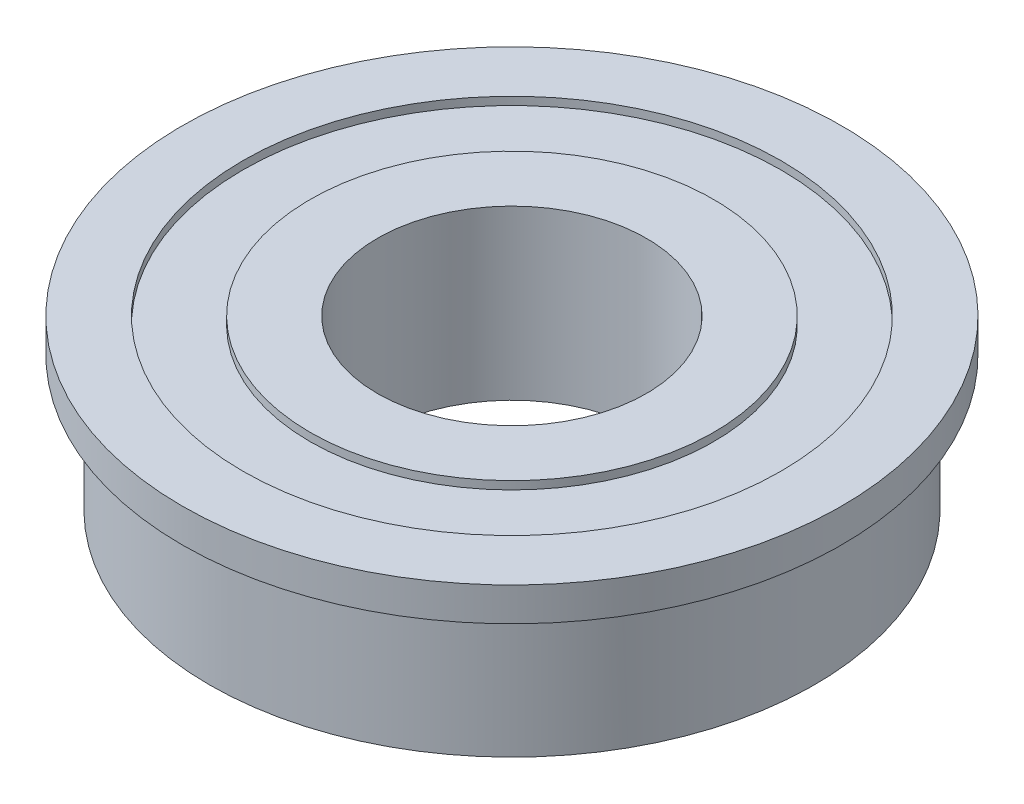
ISO-10303-21;
HEADER;
FILE_DESCRIPTION(('STEP AP214'),'2;1');
FILE_NAME('part.step','',(''),(''),'','','');
FILE_SCHEMA(('AUTOMOTIVE_DESIGN { 1 0 10303 214 1 1 1 1 }'));
ENDSEC;
DATA;
#1=APPLICATION_CONTEXT('core data for automotive mechanical design processes');
#2=APPLICATION_PROTOCOL_DEFINITION('international standard','automotive_design',2000,#1);
#3=PRODUCT_CONTEXT('',#1,'mechanical');
#4=PRODUCT('Part','Part','',(#3));
#5=PRODUCT_RELATED_PRODUCT_CATEGORY('part','',(#4));
#6=PRODUCT_DEFINITION_FORMATION('','',#4);
#7=PRODUCT_DEFINITION_CONTEXT('part definition',#1,'design');
#8=PRODUCT_DEFINITION('design','',#6,#7);
#9=PRODUCT_DEFINITION_SHAPE('','',#8);
#10=(LENGTH_UNIT() NAMED_UNIT(*) SI_UNIT(.MILLI.,.METRE.));
#11=(NAMED_UNIT(*) PLANE_ANGLE_UNIT() SI_UNIT($,.RADIAN.));
#12=(NAMED_UNIT(*) SI_UNIT($,.STERADIAN.) SOLID_ANGLE_UNIT());
#13=UNCERTAINTY_MEASURE_WITH_UNIT(LENGTH_MEASURE(1.E-05),#10,'distance_accuracy_value','');
#14=(GEOMETRIC_REPRESENTATION_CONTEXT(3) GLOBAL_UNCERTAINTY_ASSIGNED_CONTEXT((#13)) GLOBAL_UNIT_ASSIGNED_CONTEXT((#10,
#11,#12)) REPRESENTATION_CONTEXT('',''));
#15=CARTESIAN_POINT('',(0.,0.,0.));
#16=DIRECTION('',(0.,0.,1.));
#17=DIRECTION('',(1.,0.,0.));
#18=AXIS2_PLACEMENT_3D('',#15,#16,#17);
#19=CARTESIAN_POINT('',(12.7,7.9375,0.));
#20=DIRECTION('',(0.,1.,0.));
#21=DIRECTION('',(0.,0.,1.));
#22=AXIS2_PLACEMENT_3D('',#19,#20,#21);
#23=PLANE('',#22);
#24=CARTESIAN_POINT('',(0.,7.9375,0.));
#25=DIRECTION('',(0.,1.,0.));
#26=DIRECTION('',(0.,0.,1.));
#27=AXIS2_PLACEMENT_3D('',#24,#25,#26);
#28=CIRCLE('',#27,12.7);
#29=CARTESIAN_POINT('',(0.,7.9375,12.7));
#30=VERTEX_POINT('',#29);
#31=EDGE_CURVE('E93',#30,#30,#28,.F.);
#32=ORIENTED_EDGE('',*,*,#31,.T.);
#33=EDGE_LOOP('',(#32));
#34=FACE_BOUND('',#33,.T.);
#35=CARTESIAN_POINT('',(0.,7.9375,0.));
#36=DIRECTION('',(0.,1.,0.));
#37=DIRECTION('',(0.,0.,1.));
#38=AXIS2_PLACEMENT_3D('',#35,#36,#37);
#39=CIRCLE('',#38,15.5575);
#40=CARTESIAN_POINT('',(0.,7.9375,15.5575));
#41=VERTEX_POINT('',#40);
#42=EDGE_CURVE('E49',#41,#41,#39,.F.);
#43=ORIENTED_EDGE('',*,*,#42,.F.);
#44=EDGE_LOOP('',(#43));
#45=FACE_BOUND('',#44,.T.);
#46=ADVANCED_FACE('F16',(#34,#45),#23,.T.);
#47=CARTESIAN_POINT('',(0.,0.,0.));
#48=DIRECTION('',(0.,1.,0.));
#49=DIRECTION('',(0.,0.,1.));
#50=AXIS2_PLACEMENT_3D('',#47,#48,#49);
#51=CYLINDRICAL_SURFACE('',#50,15.5575);
#52=CARTESIAN_POINT('',(0.,6.35,0.));
#53=DIRECTION('',(0.,1.,0.));
#54=DIRECTION('',(0.,0.,1.));
#55=AXIS2_PLACEMENT_3D('',#52,#53,#54);
#56=CIRCLE('',#55,15.5575);
#57=CARTESIAN_POINT('',(0.,6.35,15.5575));
#58=VERTEX_POINT('',#57);
#59=EDGE_CURVE('E91',#58,#58,#56,.F.);
#60=ORIENTED_EDGE('',*,*,#59,.F.);
#61=EDGE_LOOP('',(#60));
#62=FACE_BOUND('',#61,.T.);
#63=ORIENTED_EDGE('',*,*,#42,.T.);
#64=EDGE_LOOP('',(#63));
#65=FACE_BOUND('',#64,.T.);
#66=ADVANCED_FACE('F100',(#62,#65),#51,.T.);
#67=CARTESIAN_POINT('',(0.,0.,0.));
#68=DIRECTION('',(0.,1.,0.));
#69=DIRECTION('',(0.,0.,1.));
#70=AXIS2_PLACEMENT_3D('',#67,#68,#69);
#71=CYLINDRICAL_SURFACE('',#70,12.7);
#72=ORIENTED_EDGE('',*,*,#31,.F.);
#73=EDGE_LOOP('',(#72));
#74=FACE_BOUND('',#73,.T.);
#75=CARTESIAN_POINT('',(0.,7.5565,0.));
#76=DIRECTION('',(0.,1.,0.));
#77=DIRECTION('',(0.,0.,1.));
#78=AXIS2_PLACEMENT_3D('',#75,#76,#77);
#79=CIRCLE('',#78,12.7);
#80=CARTESIAN_POINT('',(0.,7.5565,12.7));
#81=VERTEX_POINT('',#80);
#82=EDGE_CURVE('E40',#81,#81,#79,.T.);
#83=ORIENTED_EDGE('',*,*,#82,.F.);
#84=EDGE_LOOP('',(#83));
#85=FACE_BOUND('',#84,.T.);
#86=ADVANCED_FACE('F107',(#74,#85),#71,.F.);
#87=CARTESIAN_POINT('',(15.5575,6.35,0.));
#88=DIRECTION('',(0.,-1.,0.));
#89=DIRECTION('',(0.,0.,-1.));
#90=AXIS2_PLACEMENT_3D('',#87,#88,#89);
#91=PLANE('',#90);
#92=ORIENTED_EDGE('',*,*,#59,.T.);
#93=EDGE_LOOP('',(#92));
#94=FACE_BOUND('',#93,.T.);
#95=CARTESIAN_POINT('',(0.,6.35,0.));
#96=DIRECTION('',(0.,-1.,0.));
#97=DIRECTION('',(0.,0.,-1.));
#98=AXIS2_PLACEMENT_3D('',#95,#96,#97);
#99=CIRCLE('',#98,14.2875);
#100=CARTESIAN_POINT('',(0.,6.35,14.2875));
#101=VERTEX_POINT('',#100);
#102=CARTESIAN_POINT('',(0.,6.35,-14.2875));
#103=VERTEX_POINT('',#102);
#104=EDGE_CURVE('E36',#101,#103,#99,.F.);
#105=ORIENTED_EDGE('',*,*,#104,.T.);
#106=CARTESIAN_POINT('',(0.,6.35,0.));
#107=DIRECTION('',(0.,-1.,0.));
#108=DIRECTION('',(0.,0.,1.));
#109=AXIS2_PLACEMENT_3D('',#106,#107,#108);
#110=CIRCLE('',#109,14.2875);
#111=EDGE_CURVE('E33',#103,#101,#110,.F.);
#112=ORIENTED_EDGE('',*,*,#111,.T.);
#113=EDGE_LOOP('',(#105,#112));
#114=FACE_BOUND('',#113,.T.);
#115=ADVANCED_FACE('F38',(#94,#114),#91,.T.);
#116=CARTESIAN_POINT('',(9.525,7.5565,0.));
#117=DIRECTION('',(0.,1.,0.));
#118=DIRECTION('',(0.,0.,1.));
#119=AXIS2_PLACEMENT_3D('',#116,#117,#118);
#120=PLANE('',#119);
#121=CARTESIAN_POINT('',(0.,7.5565,0.));
#122=DIRECTION('',(0.,1.,0.));
#123=DIRECTION('',(0.,0.,1.));
#124=AXIS2_PLACEMENT_3D('',#121,#122,#123);
#125=CIRCLE('',#124,9.525);
#126=CARTESIAN_POINT('',(0.,7.5565,9.525));
#127=VERTEX_POINT('',#126);
#128=EDGE_CURVE('E46',#127,#127,#125,.T.);
#129=ORIENTED_EDGE('',*,*,#128,.F.);
#130=EDGE_LOOP('',(#129));
#131=FACE_BOUND('',#130,.T.);
#132=ORIENTED_EDGE('',*,*,#82,.T.);
#133=EDGE_LOOP('',(#132));
#134=FACE_BOUND('',#133,.T.);
#135=ADVANCED_FACE('F139',(#131,#134),#120,.T.);
#136=CARTESIAN_POINT('',(0.,0.,0.));
#137=DIRECTION('',(0.,1.,0.));
#138=DIRECTION('',(0.,0.,1.));
#139=AXIS2_PLACEMENT_3D('',#136,#137,#138);
#140=CYLINDRICAL_SURFACE('',#139,9.525);
#141=ORIENTED_EDGE('',*,*,#128,.T.);
#142=EDGE_LOOP('',(#141));
#143=FACE_BOUND('',#142,.T.);
#144=CARTESIAN_POINT('',(0.,7.9375,0.));
#145=DIRECTION('',(0.,1.,0.));
#146=DIRECTION('',(0.,0.,1.));
#147=AXIS2_PLACEMENT_3D('',#144,#145,#146);
#148=CIRCLE('',#147,9.525);
#149=CARTESIAN_POINT('',(0.,7.9375,9.525));
#150=VERTEX_POINT('',#149);
#151=EDGE_CURVE('E73',#150,#150,#148,.T.);
#152=ORIENTED_EDGE('',*,*,#151,.F.);
#153=EDGE_LOOP('',(#152));
#154=FACE_BOUND('',#153,.T.);
#155=ADVANCED_FACE('F63',(#143,#154),#140,.T.);
#156=CARTESIAN_POINT('',(0.,6.1,0.));
#157=DIRECTION('',(0.,1.,0.));
#158=DIRECTION('',(0.,0.,1.));
#159=AXIS2_PLACEMENT_3D('',#156,#157,#158);
#160=TOROIDAL_SURFACE('',#159,14.2875,0.250000000000001);
#161=ORIENTED_EDGE('',*,*,#111,.F.);
#162=ORIENTED_EDGE('',*,*,#104,.F.);
#163=EDGE_LOOP('',(#161,#162));
#164=FACE_BOUND('',#163,.T.);
#165=CARTESIAN_POINT('',(0.,5.975,0.));
#166=DIRECTION('',(0.,-1.,0.));
#167=DIRECTION('',(0.,0.,-1.));
#168=AXIS2_PLACEMENT_3D('',#165,#166,#167);
#169=CIRCLE('',#168,14.0709936490539);
#170=CARTESIAN_POINT('',(0.,5.975,-14.0709936490539));
#171=VERTEX_POINT('',#170);
#172=EDGE_CURVE('E69',#171,#171,#169,.T.);
#173=ORIENTED_EDGE('',*,*,#172,.F.);
#174=EDGE_LOOP('',(#173));
#175=FACE_BOUND('',#174,.T.);
#176=ADVANCED_FACE('F44',(#164,#175),#160,.F.);
#177=CARTESIAN_POINT('',(6.35,7.9375,0.));
#178=DIRECTION('',(0.,1.,0.));
#179=DIRECTION('',(0.,0.,1.));
#180=AXIS2_PLACEMENT_3D('',#177,#178,#179);
#181=PLANE('',#180);
#182=CARTESIAN_POINT('',(0.,7.9375,0.));
#183=DIRECTION('',(0.,1.,0.));
#184=DIRECTION('',(0.,0.,1.));
#185=AXIS2_PLACEMENT_3D('',#182,#183,#184);
#186=CIRCLE('',#185,6.35);
#187=CARTESIAN_POINT('',(0.,7.9375,6.35));
#188=VERTEX_POINT('',#187);
#189=EDGE_CURVE('E72',#188,#188,#186,.F.);
#190=ORIENTED_EDGE('',*,*,#189,.T.);
#191=EDGE_LOOP('',(#190));
#192=FACE_BOUND('',#191,.T.);
#193=ORIENTED_EDGE('',*,*,#151,.T.);
#194=EDGE_LOOP('',(#193));
#195=FACE_BOUND('',#194,.T.);
#196=ADVANCED_FACE('F62',(#192,#195),#181,.T.);
#197=CARTESIAN_POINT('',(0.,5.6,0.));
#198=DIRECTION('',(0.,-1.,0.));
#199=DIRECTION('',(1.,0.,0.));
#200=AXIS2_PLACEMENT_3D('',#197,#198,#199);
#201=CONICAL_SURFACE('',#200,14.2875,0.5235987755983);
#202=ORIENTED_EDGE('',*,*,#172,.T.);
#203=EDGE_LOOP('',(#202));
#204=FACE_BOUND('',#203,.T.);
#205=CARTESIAN_POINT('',(0.,5.6,0.));
#206=DIRECTION('',(0.,1.,0.));
#207=DIRECTION('',(0.,0.,1.));
#208=AXIS2_PLACEMENT_3D('',#205,#206,#207);
#209=CIRCLE('',#208,14.2875);
#210=CARTESIAN_POINT('',(0.,5.6,14.2875));
#211=VERTEX_POINT('',#210);
#212=EDGE_CURVE('E74',#211,#211,#209,.F.);
#213=ORIENTED_EDGE('',*,*,#212,.F.);
#214=EDGE_LOOP('',(#213));
#215=FACE_BOUND('',#214,.T.);
#216=ADVANCED_FACE('F124',(#204,#215),#201,.T.);
#217=CARTESIAN_POINT('',(0.,0.,0.));
#218=DIRECTION('',(0.,1.,0.));
#219=DIRECTION('',(0.,0.,1.));
#220=AXIS2_PLACEMENT_3D('',#217,#218,#219);
#221=CYLINDRICAL_SURFACE('',#220,6.35);
#222=ORIENTED_EDGE('',*,*,#189,.F.);
#223=EDGE_LOOP('',(#222));
#224=FACE_BOUND('',#223,.T.);
#225=CARTESIAN_POINT('',(0.,0.,0.));
#226=DIRECTION('',(0.,1.,0.));
#227=DIRECTION('',(0.,0.,1.));
#228=AXIS2_PLACEMENT_3D('',#225,#226,#227);
#229=CIRCLE('',#228,6.35);
#230=CARTESIAN_POINT('',(0.,0.,6.35));
#231=VERTEX_POINT('',#230);
#232=EDGE_CURVE('E26',#231,#231,#229,.T.);
#233=ORIENTED_EDGE('',*,*,#232,.F.);
#234=EDGE_LOOP('',(#233));
#235=FACE_BOUND('',#234,.T.);
#236=ADVANCED_FACE('F118',(#224,#235),#221,.F.);
#237=CARTESIAN_POINT('',(0.,0.,0.));
#238=DIRECTION('',(0.,1.,0.));
#239=DIRECTION('',(0.,0.,1.));
#240=AXIS2_PLACEMENT_3D('',#237,#238,#239);
#241=CYLINDRICAL_SURFACE('',#240,14.2875);
#242=CARTESIAN_POINT('',(0.,0.,0.));
#243=DIRECTION('',(0.,1.,0.));
#244=DIRECTION('',(0.,0.,1.));
#245=AXIS2_PLACEMENT_3D('',#242,#243,#244);
#246=CIRCLE('',#245,14.2875);
#247=CARTESIAN_POINT('',(0.,0.,14.2875));
#248=VERTEX_POINT('',#247);
#249=EDGE_CURVE('E11',#248,#248,#246,.F.);
#250=ORIENTED_EDGE('',*,*,#249,.F.);
#251=EDGE_LOOP('',(#250));
#252=FACE_BOUND('',#251,.T.);
#253=ORIENTED_EDGE('',*,*,#212,.T.);
#254=EDGE_LOOP('',(#253));
#255=FACE_BOUND('',#254,.T.);
#256=ADVANCED_FACE('F111',(#252,#255),#241,.T.);
#257=CARTESIAN_POINT('',(14.2875,0.,0.));
#258=DIRECTION('',(0.,-1.,0.));
#259=DIRECTION('',(0.,0.,-1.));
#260=AXIS2_PLACEMENT_3D('',#257,#258,#259);
#261=PLANE('',#260);
#262=ORIENTED_EDGE('',*,*,#249,.T.);
#263=EDGE_LOOP('',(#262));
#264=FACE_BOUND('',#263,.T.);
#265=ORIENTED_EDGE('',*,*,#232,.T.);
#266=EDGE_LOOP('',(#265));
#267=FACE_BOUND('',#266,.T.);
#268=ADVANCED_FACE('F109',(#264,#267),#261,.T.);
#269=CLOSED_SHELL('',(#46,#66,#86,#115,#135,#155,#176,#196,#216,#236,#256,#268));
#270=MANIFOLD_SOLID_BREP('B1',#269);
#271=ADVANCED_BREP_SHAPE_REPRESENTATION('',(#18,#270),#14);
#272=SHAPE_DEFINITION_REPRESENTATION(#9,#271);
ENDSEC;
END-ISO-10303-21;
